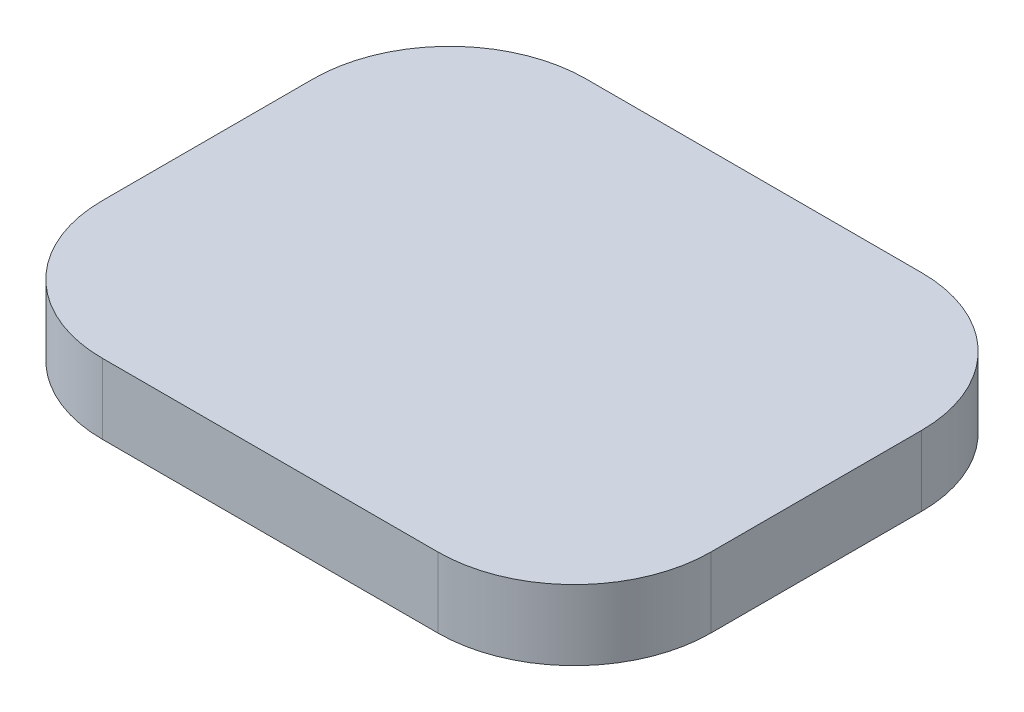
ISO-10303-21;
HEADER;
FILE_DESCRIPTION(('STEP AP214'),'2;1');
FILE_NAME('part.step','',(''),(''),'','','');
FILE_SCHEMA(('AUTOMOTIVE_DESIGN { 1 0 10303 214 1 1 1 1 }'));
ENDSEC;
DATA;
#1=APPLICATION_CONTEXT('core data for automotive mechanical design processes');
#2=APPLICATION_PROTOCOL_DEFINITION('international standard','automotive_design',2000,#1);
#3=PRODUCT_CONTEXT('',#1,'mechanical');
#4=PRODUCT('Part','Part','',(#3));
#5=PRODUCT_RELATED_PRODUCT_CATEGORY('part','',(#4));
#6=PRODUCT_DEFINITION_FORMATION('','',#4);
#7=PRODUCT_DEFINITION_CONTEXT('part definition',#1,'design');
#8=PRODUCT_DEFINITION('design','',#6,#7);
#9=PRODUCT_DEFINITION_SHAPE('','',#8);
#10=(LENGTH_UNIT() NAMED_UNIT(*) SI_UNIT(.MILLI.,.METRE.));
#11=(NAMED_UNIT(*) PLANE_ANGLE_UNIT() SI_UNIT($,.RADIAN.));
#12=(NAMED_UNIT(*) SI_UNIT($,.STERADIAN.) SOLID_ANGLE_UNIT());
#13=UNCERTAINTY_MEASURE_WITH_UNIT(LENGTH_MEASURE(1.E-05),#10,'distance_accuracy_value','');
#14=(GEOMETRIC_REPRESENTATION_CONTEXT(3) GLOBAL_UNCERTAINTY_ASSIGNED_CONTEXT((#13)) GLOBAL_UNIT_ASSIGNED_CONTEXT((#10,
#11,#12)) REPRESENTATION_CONTEXT('',''));
#15=CARTESIAN_POINT('',(0.,0.,0.));
#16=DIRECTION('',(0.,0.,1.));
#17=DIRECTION('',(1.,0.,0.));
#18=AXIS2_PLACEMENT_3D('',#15,#16,#17);
#19=CARTESIAN_POINT('',(-39.,9.,-31.));
#20=DIRECTION('',(1.,0.,0.));
#21=DIRECTION('',(0.,0.,-1.));
#22=AXIS2_PLACEMENT_3D('',#19,#20,#21);
#23=PLANE('',#22);
#24=DIRECTION('',(0.,0.,1.));
#25=VECTOR('',#24,1.);
#26=CARTESIAN_POINT('',(-39.,9.,-31.));
#27=LINE('',#26,#25);
#28=CARTESIAN_POINT('',(-39.,9.,-13.5));
#29=VERTEX_POINT('',#28);
#30=CARTESIAN_POINT('',(-39.,9.,13.5));
#31=VERTEX_POINT('',#30);
#32=EDGE_CURVE('E130',#29,#31,#27,.T.);
#33=ORIENTED_EDGE('',*,*,#32,.F.);
#34=DIRECTION('',(0.,-1.,0.));
#35=VECTOR('',#34,1.);
#36=CARTESIAN_POINT('',(-39.,9.,-13.5));
#37=LINE('',#36,#35);
#38=CARTESIAN_POINT('',(-39.,0.,-13.5));
#39=VERTEX_POINT('',#38);
#40=EDGE_CURVE('E115',#29,#39,#37,.T.);
#41=ORIENTED_EDGE('',*,*,#40,.T.);
#42=DIRECTION('',(0.,0.,1.));
#43=VECTOR('',#42,1.);
#44=CARTESIAN_POINT('',(-39.,0.,-31.));
#45=LINE('',#44,#43);
#46=CARTESIAN_POINT('',(-39.,0.,13.5));
#47=VERTEX_POINT('',#46);
#48=EDGE_CURVE('E127',#39,#47,#45,.T.);
#49=ORIENTED_EDGE('',*,*,#48,.T.);
#50=DIRECTION('',(0.,-1.,0.));
#51=VECTOR('',#50,1.);
#52=CARTESIAN_POINT('',(-39.,9.,13.5));
#53=LINE('',#52,#51);
#54=EDGE_CURVE('E132',#47,#31,#53,.F.);
#55=ORIENTED_EDGE('',*,*,#54,.T.);
#56=EDGE_LOOP('',(#33,#41,#49,#55));
#57=FACE_BOUND('',#56,.T.);
#58=ADVANCED_FACE('F44',(#57),#23,.F.);
#59=CARTESIAN_POINT('',(-39.,9.,31.));
#60=DIRECTION('',(0.,0.,-1.));
#61=DIRECTION('',(-1.,0.,0.));
#62=AXIS2_PLACEMENT_3D('',#59,#60,#61);
#63=PLANE('',#62);
#64=DIRECTION('',(1.,0.,0.));
#65=VECTOR('',#64,1.);
#66=CARTESIAN_POINT('',(-39.,9.,31.));
#67=LINE('',#66,#65);
#68=CARTESIAN_POINT('',(-21.5,9.,31.));
#69=VERTEX_POINT('',#68);
#70=CARTESIAN_POINT('',(21.5,9.,31.));
#71=VERTEX_POINT('',#70);
#72=EDGE_CURVE('E170',#69,#71,#67,.T.);
#73=ORIENTED_EDGE('',*,*,#72,.F.);
#74=DIRECTION('',(0.,-1.,0.));
#75=VECTOR('',#74,1.);
#76=CARTESIAN_POINT('',(-21.5,9.,31.));
#77=LINE('',#76,#75);
#78=CARTESIAN_POINT('',(-21.5,0.,31.));
#79=VERTEX_POINT('',#78);
#80=EDGE_CURVE('E13',#69,#79,#77,.T.);
#81=ORIENTED_EDGE('',*,*,#80,.T.);
#82=DIRECTION('',(1.,0.,0.));
#83=VECTOR('',#82,1.);
#84=CARTESIAN_POINT('',(-39.,0.,31.));
#85=LINE('',#84,#83);
#86=CARTESIAN_POINT('',(21.5,0.,31.));
#87=VERTEX_POINT('',#86);
#88=EDGE_CURVE('E137',#79,#87,#85,.T.);
#89=ORIENTED_EDGE('',*,*,#88,.T.);
#90=DIRECTION('',(0.,-1.,0.));
#91=VECTOR('',#90,1.);
#92=CARTESIAN_POINT('',(21.5,9.,31.));
#93=LINE('',#92,#91);
#94=EDGE_CURVE('E52',#87,#71,#93,.F.);
#95=ORIENTED_EDGE('',*,*,#94,.T.);
#96=EDGE_LOOP('',(#73,#81,#89,#95));
#97=FACE_BOUND('',#96,.T.);
#98=ADVANCED_FACE('F169',(#97),#63,.F.);
#99=CARTESIAN_POINT('',(39.,9.,-31.));
#100=DIRECTION('',(-1.,0.,0.));
#101=DIRECTION('',(0.,0.,1.));
#102=AXIS2_PLACEMENT_3D('',#99,#100,#101);
#103=PLANE('',#102);
#104=DIRECTION('',(0.,0.,-1.));
#105=VECTOR('',#104,1.);
#106=CARTESIAN_POINT('',(39.,0.,-31.));
#107=LINE('',#106,#105);
#108=CARTESIAN_POINT('',(39.,0.,13.5));
#109=VERTEX_POINT('',#108);
#110=CARTESIAN_POINT('',(39.,0.,-13.5));
#111=VERTEX_POINT('',#110);
#112=EDGE_CURVE('E140',#109,#111,#107,.T.);
#113=ORIENTED_EDGE('',*,*,#112,.T.);
#114=DIRECTION('',(0.,-1.,0.));
#115=VECTOR('',#114,1.);
#116=CARTESIAN_POINT('',(39.,9.,-13.5));
#117=LINE('',#116,#115);
#118=CARTESIAN_POINT('',(39.,9.,-13.5));
#119=VERTEX_POINT('',#118);
#120=EDGE_CURVE('E59',#111,#119,#117,.F.);
#121=ORIENTED_EDGE('',*,*,#120,.T.);
#122=DIRECTION('',(0.,0.,-1.));
#123=VECTOR('',#122,1.);
#124=CARTESIAN_POINT('',(39.,9.,-31.));
#125=LINE('',#124,#123);
#126=CARTESIAN_POINT('',(39.,9.,13.5));
#127=VERTEX_POINT('',#126);
#128=EDGE_CURVE('E176',#127,#119,#125,.T.);
#129=ORIENTED_EDGE('',*,*,#128,.F.);
#130=DIRECTION('',(0.,-1.,0.));
#131=VECTOR('',#130,1.);
#132=CARTESIAN_POINT('',(39.,9.,13.5));
#133=LINE('',#132,#131);
#134=EDGE_CURVE('E163',#127,#109,#133,.T.);
#135=ORIENTED_EDGE('',*,*,#134,.T.);
#136=EDGE_LOOP('',(#113,#121,#129,#135));
#137=FACE_BOUND('',#136,.T.);
#138=ADVANCED_FACE('F180',(#137),#103,.F.);
#139=CARTESIAN_POINT('',(-39.,9.,-31.));
#140=DIRECTION('',(0.,0.,1.));
#141=DIRECTION('',(1.,0.,0.));
#142=AXIS2_PLACEMENT_3D('',#139,#140,#141);
#143=PLANE('',#142);
#144=DIRECTION('',(-1.,0.,0.));
#145=VECTOR('',#144,1.);
#146=CARTESIAN_POINT('',(-39.,0.,-31.));
#147=LINE('',#146,#145);
#148=CARTESIAN_POINT('',(21.5,0.,-31.));
#149=VERTEX_POINT('',#148);
#150=CARTESIAN_POINT('',(-21.5,0.,-31.));
#151=VERTEX_POINT('',#150);
#152=EDGE_CURVE('E147',#149,#151,#147,.T.);
#153=ORIENTED_EDGE('',*,*,#152,.T.);
#154=DIRECTION('',(0.,-1.,0.));
#155=VECTOR('',#154,1.);
#156=CARTESIAN_POINT('',(-21.5,9.,-31.));
#157=LINE('',#156,#155);
#158=CARTESIAN_POINT('',(-21.5,9.,-31.));
#159=VERTEX_POINT('',#158);
#160=EDGE_CURVE('E116',#151,#159,#157,.F.);
#161=ORIENTED_EDGE('',*,*,#160,.T.);
#162=DIRECTION('',(-1.,0.,0.));
#163=VECTOR('',#162,1.);
#164=CARTESIAN_POINT('',(-39.,9.,-31.));
#165=LINE('',#164,#163);
#166=CARTESIAN_POINT('',(21.5,9.,-31.));
#167=VERTEX_POINT('',#166);
#168=EDGE_CURVE('E143',#167,#159,#165,.T.);
#169=ORIENTED_EDGE('',*,*,#168,.F.);
#170=DIRECTION('',(0.,-1.,0.));
#171=VECTOR('',#170,1.);
#172=CARTESIAN_POINT('',(21.5,9.,-31.));
#173=LINE('',#172,#171);
#174=EDGE_CURVE('E121',#167,#149,#173,.T.);
#175=ORIENTED_EDGE('',*,*,#174,.T.);
#176=EDGE_LOOP('',(#153,#161,#169,#175));
#177=FACE_BOUND('',#176,.T.);
#178=ADVANCED_FACE('F187',(#177),#143,.F.);
#179=CARTESIAN_POINT('',(0.,9.,0.));
#180=DIRECTION('',(0.,1.,0.));
#181=DIRECTION('',(0.,0.,1.));
#182=AXIS2_PLACEMENT_3D('',#179,#180,#181);
#183=PLANE('',#182);
#184=ORIENTED_EDGE('',*,*,#168,.T.);
#185=CARTESIAN_POINT('',(-21.5,9.,-13.5));
#186=DIRECTION('',(0.,1.,0.));
#187=DIRECTION('',(0.,0.,1.));
#188=AXIS2_PLACEMENT_3D('',#185,#186,#187);
#189=CIRCLE('',#188,17.5);
#190=EDGE_CURVE('E161',#159,#29,#189,.T.);
#191=ORIENTED_EDGE('',*,*,#190,.T.);
#192=ORIENTED_EDGE('',*,*,#32,.T.);
#193=CARTESIAN_POINT('',(-21.5,9.,13.5));
#194=DIRECTION('',(0.,1.,0.));
#195=DIRECTION('',(0.,0.,1.));
#196=AXIS2_PLACEMENT_3D('',#193,#194,#195);
#197=CIRCLE('',#196,17.5);
#198=EDGE_CURVE('E157',#31,#69,#197,.T.);
#199=ORIENTED_EDGE('',*,*,#198,.T.);
#200=ORIENTED_EDGE('',*,*,#72,.T.);
#201=CARTESIAN_POINT('',(21.5,9.,13.5));
#202=DIRECTION('',(0.,1.,0.));
#203=DIRECTION('',(0.,0.,1.));
#204=AXIS2_PLACEMENT_3D('',#201,#202,#203);
#205=CIRCLE('',#204,17.5);
#206=EDGE_CURVE('E66',#71,#127,#205,.T.);
#207=ORIENTED_EDGE('',*,*,#206,.T.);
#208=ORIENTED_EDGE('',*,*,#128,.T.);
#209=CARTESIAN_POINT('',(21.5,9.,-13.5));
#210=DIRECTION('',(0.,1.,0.));
#211=DIRECTION('',(0.,0.,1.));
#212=AXIS2_PLACEMENT_3D('',#209,#210,#211);
#213=CIRCLE('',#212,17.5);
#214=EDGE_CURVE('E159',#119,#167,#213,.T.);
#215=ORIENTED_EDGE('',*,*,#214,.T.);
#216=EDGE_LOOP('',(#184,#191,#192,#199,#200,#207,#208,#215));
#217=FACE_BOUND('',#216,.T.);
#218=ADVANCED_FACE('F174',(#217),#183,.T.);
#219=CARTESIAN_POINT('',(0.,0.,0.));
#220=DIRECTION('',(0.,1.,0.));
#221=DIRECTION('',(0.,0.,1.));
#222=AXIS2_PLACEMENT_3D('',#219,#220,#221);
#223=PLANE('',#222);
#224=ORIENTED_EDGE('',*,*,#48,.F.);
#225=CARTESIAN_POINT('',(-21.5,0.,-13.5));
#226=DIRECTION('',(0.,1.,0.));
#227=DIRECTION('',(0.,0.,1.));
#228=AXIS2_PLACEMENT_3D('',#225,#226,#227);
#229=CIRCLE('',#228,17.5);
#230=EDGE_CURVE('E111',#39,#151,#229,.F.);
#231=ORIENTED_EDGE('',*,*,#230,.T.);
#232=ORIENTED_EDGE('',*,*,#152,.F.);
#233=CARTESIAN_POINT('',(21.5,0.,-13.5));
#234=DIRECTION('',(0.,1.,0.));
#235=DIRECTION('',(0.,0.,1.));
#236=AXIS2_PLACEMENT_3D('',#233,#234,#235);
#237=CIRCLE('',#236,17.5);
#238=EDGE_CURVE('E122',#149,#111,#237,.F.);
#239=ORIENTED_EDGE('',*,*,#238,.T.);
#240=ORIENTED_EDGE('',*,*,#112,.F.);
#241=CARTESIAN_POINT('',(21.5,0.,13.5));
#242=DIRECTION('',(0.,1.,0.));
#243=DIRECTION('',(0.,0.,1.));
#244=AXIS2_PLACEMENT_3D('',#241,#242,#243);
#245=CIRCLE('',#244,17.5);
#246=EDGE_CURVE('E131',#109,#87,#245,.F.);
#247=ORIENTED_EDGE('',*,*,#246,.T.);
#248=ORIENTED_EDGE('',*,*,#88,.F.);
#249=CARTESIAN_POINT('',(-21.5,0.,13.5));
#250=DIRECTION('',(0.,1.,0.));
#251=DIRECTION('',(0.,0.,1.));
#252=AXIS2_PLACEMENT_3D('',#249,#250,#251);
#253=CIRCLE('',#252,17.5);
#254=EDGE_CURVE('E136',#79,#47,#253,.F.);
#255=ORIENTED_EDGE('',*,*,#254,.T.);
#256=EDGE_LOOP('',(#224,#231,#232,#239,#240,#247,#248,#255));
#257=FACE_BOUND('',#256,.T.);
#258=ADVANCED_FACE('F134',(#257),#223,.F.);
#259=CARTESIAN_POINT('',(-21.5,9.,-13.5));
#260=DIRECTION('',(0.,-1.,0.));
#261=DIRECTION('',(0.,0.,-1.));
#262=AXIS2_PLACEMENT_3D('',#259,#260,#261);
#263=CYLINDRICAL_SURFACE('',#262,17.5);
#264=ORIENTED_EDGE('',*,*,#190,.F.);
#265=ORIENTED_EDGE('',*,*,#160,.F.);
#266=ORIENTED_EDGE('',*,*,#230,.F.);
#267=ORIENTED_EDGE('',*,*,#40,.F.);
#268=EDGE_LOOP('',(#264,#265,#266,#267));
#269=FACE_BOUND('',#268,.T.);
#270=ADVANCED_FACE('F114',(#269),#263,.T.);
#271=CARTESIAN_POINT('',(21.5,9.,-13.5));
#272=DIRECTION('',(0.,-1.,0.));
#273=DIRECTION('',(0.,0.,-1.));
#274=AXIS2_PLACEMENT_3D('',#271,#272,#273);
#275=CYLINDRICAL_SURFACE('',#274,17.5);
#276=ORIENTED_EDGE('',*,*,#214,.F.);
#277=ORIENTED_EDGE('',*,*,#120,.F.);
#278=ORIENTED_EDGE('',*,*,#238,.F.);
#279=ORIENTED_EDGE('',*,*,#174,.F.);
#280=EDGE_LOOP('',(#276,#277,#278,#279));
#281=FACE_BOUND('',#280,.T.);
#282=ADVANCED_FACE('F184',(#281),#275,.T.);
#283=CARTESIAN_POINT('',(-21.5,9.,13.5));
#284=DIRECTION('',(0.,-1.,0.));
#285=DIRECTION('',(0.,0.,-1.));
#286=AXIS2_PLACEMENT_3D('',#283,#284,#285);
#287=CYLINDRICAL_SURFACE('',#286,17.5);
#288=ORIENTED_EDGE('',*,*,#198,.F.);
#289=ORIENTED_EDGE('',*,*,#54,.F.);
#290=ORIENTED_EDGE('',*,*,#254,.F.);
#291=ORIENTED_EDGE('',*,*,#80,.F.);
#292=EDGE_LOOP('',(#288,#289,#290,#291));
#293=FACE_BOUND('',#292,.T.);
#294=ADVANCED_FACE('F190',(#293),#287,.T.);
#295=CARTESIAN_POINT('',(21.5,9.,13.5));
#296=DIRECTION('',(0.,-1.,0.));
#297=DIRECTION('',(0.,0.,-1.));
#298=AXIS2_PLACEMENT_3D('',#295,#296,#297);
#299=CYLINDRICAL_SURFACE('',#298,17.5);
#300=ORIENTED_EDGE('',*,*,#206,.F.);
#301=ORIENTED_EDGE('',*,*,#94,.F.);
#302=ORIENTED_EDGE('',*,*,#246,.F.);
#303=ORIENTED_EDGE('',*,*,#134,.F.);
#304=EDGE_LOOP('',(#300,#301,#302,#303));
#305=FACE_BOUND('',#304,.T.);
#306=ADVANCED_FACE('F46',(#305),#299,.T.);
#307=CLOSED_SHELL('',(#58,#98,#138,#178,#218,#258,#270,#282,#294,#306));
#308=MANIFOLD_SOLID_BREP('B2',#307);
#309=ADVANCED_BREP_SHAPE_REPRESENTATION('',(#18,#308),#14);
#310=SHAPE_DEFINITION_REPRESENTATION(#9,#309);
ENDSEC;
END-ISO-10303-21;
